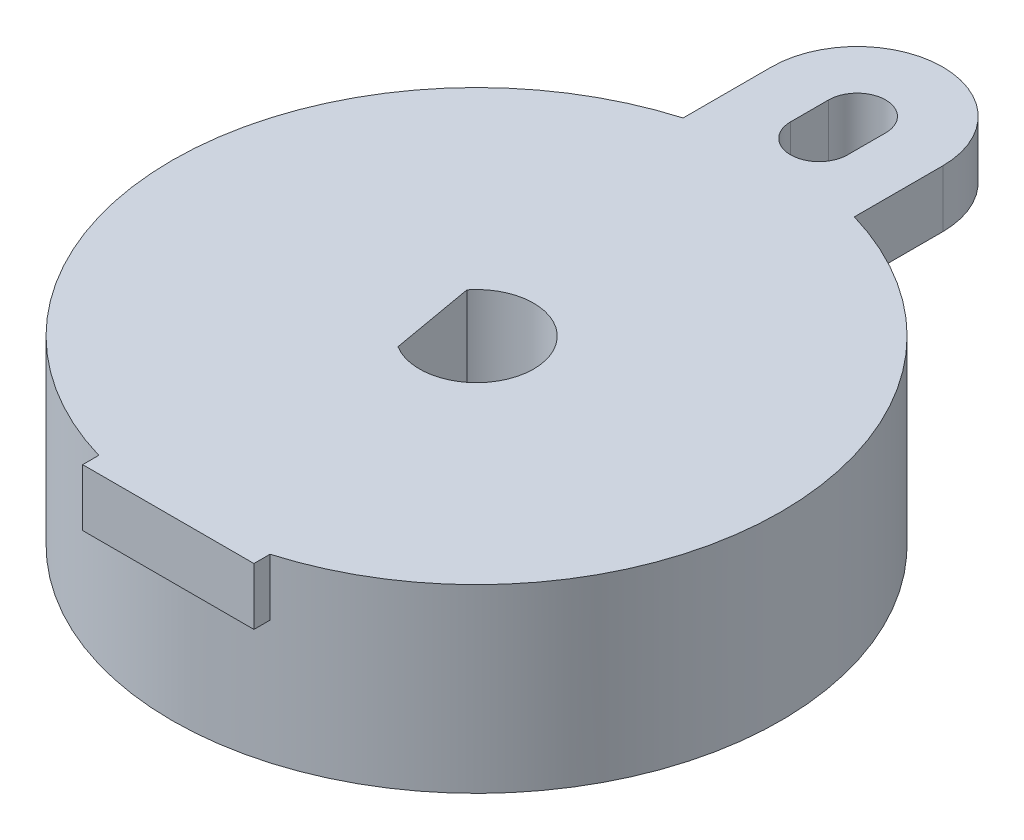
ISO-10303-21;
HEADER;
FILE_DESCRIPTION(('STEP AP214'),'2;1');
FILE_NAME('part.step','',(''),(''),'','','');
FILE_SCHEMA(('AUTOMOTIVE_DESIGN { 1 0 10303 214 1 1 1 1 }'));
ENDSEC;
DATA;
#1=APPLICATION_CONTEXT('core data for automotive mechanical design processes');
#2=APPLICATION_PROTOCOL_DEFINITION('international standard','automotive_design',2000,#1);
#3=PRODUCT_CONTEXT('',#1,'mechanical');
#4=PRODUCT('Part','Part','',(#3));
#5=PRODUCT_RELATED_PRODUCT_CATEGORY('part','',(#4));
#6=PRODUCT_DEFINITION_FORMATION('','',#4);
#7=PRODUCT_DEFINITION_CONTEXT('part definition',#1,'design');
#8=PRODUCT_DEFINITION('design','',#6,#7);
#9=PRODUCT_DEFINITION_SHAPE('','',#8);
#10=(LENGTH_UNIT() NAMED_UNIT(*) SI_UNIT(.MILLI.,.METRE.));
#11=(NAMED_UNIT(*) PLANE_ANGLE_UNIT() SI_UNIT($,.RADIAN.));
#12=(NAMED_UNIT(*) SI_UNIT($,.STERADIAN.) SOLID_ANGLE_UNIT());
#13=UNCERTAINTY_MEASURE_WITH_UNIT(LENGTH_MEASURE(1.E-05),#10,'distance_accuracy_value','');
#14=(GEOMETRIC_REPRESENTATION_CONTEXT(3) GLOBAL_UNCERTAINTY_ASSIGNED_CONTEXT((#13)) GLOBAL_UNIT_ASSIGNED_CONTEXT((#10,
#11,#12)) REPRESENTATION_CONTEXT('',''));
#15=CARTESIAN_POINT('',(0.,0.,0.));
#16=DIRECTION('',(0.,0.,1.));
#17=DIRECTION('',(1.,0.,0.));
#18=AXIS2_PLACEMENT_3D('',#15,#16,#17);
#19=CARTESIAN_POINT('',(-4.5,9.5,20.));
#20=DIRECTION('',(-1.,0.,0.));
#21=DIRECTION('',(0.,0.,1.));
#22=AXIS2_PLACEMENT_3D('',#19,#20,#21);
#23=PLANE('',#22);
#24=DIRECTION('',(0.,1.,0.));
#25=VECTOR('',#24,1.);
#26=CARTESIAN_POINT('',(-4.50000000000001,9.5,15.3541525327841));
#27=LINE('',#26,#25);
#28=CARTESIAN_POINT('',(-4.50000000000001,6.5,15.3541525327841));
#29=VERTEX_POINT('',#28);
#30=CARTESIAN_POINT('',(-4.50000000000001,9.5,15.3541525327841));
#31=VERTEX_POINT('',#30);
#32=EDGE_CURVE('E141',#29,#31,#27,.T.);
#33=ORIENTED_EDGE('',*,*,#32,.F.);
#34=DIRECTION('',(0.,0.,1.));
#35=VECTOR('',#34,1.);
#36=CARTESIAN_POINT('',(-4.5,6.5,0.));
#37=LINE('',#36,#35);
#38=CARTESIAN_POINT('',(-4.5,6.5,16.2));
#39=VERTEX_POINT('',#38);
#40=EDGE_CURVE('E157',#29,#39,#37,.T.);
#41=ORIENTED_EDGE('',*,*,#40,.T.);
#42=DIRECTION('',(0.,1.,0.));
#43=VECTOR('',#42,1.);
#44=CARTESIAN_POINT('',(-4.50000000000001,-75.7369297077063,16.2));
#45=LINE('',#44,#43);
#46=CARTESIAN_POINT('',(-4.50000000000001,9.5,16.2));
#47=VERTEX_POINT('',#46);
#48=EDGE_CURVE('E198',#39,#47,#45,.T.);
#49=ORIENTED_EDGE('',*,*,#48,.T.);
#50=DIRECTION('',(0.,0.,1.));
#51=VECTOR('',#50,1.);
#52=CARTESIAN_POINT('',(-4.5,9.5,20.));
#53=LINE('',#52,#51);
#54=EDGE_CURVE('E169',#47,#31,#53,.F.);
#55=ORIENTED_EDGE('',*,*,#54,.T.);
#56=EDGE_LOOP('',(#33,#41,#49,#55));
#57=FACE_BOUND('',#56,.T.);
#58=ADVANCED_FACE('F18',(#57),#23,.T.);
#59=CARTESIAN_POINT('',(4.5,9.5,20.));
#60=DIRECTION('',(1.,0.,0.));
#61=DIRECTION('',(0.,0.,-1.));
#62=AXIS2_PLACEMENT_3D('',#59,#60,#61);
#63=PLANE('',#62);
#64=DIRECTION('',(0.,1.,0.));
#65=VECTOR('',#64,1.);
#66=CARTESIAN_POINT('',(4.5,9.5,15.3541525327841));
#67=LINE('',#66,#65);
#68=CARTESIAN_POINT('',(4.5,9.5,15.3541525327841));
#69=VERTEX_POINT('',#68);
#70=CARTESIAN_POINT('',(4.50000000000001,6.5,15.3541525327841));
#71=VERTEX_POINT('',#70);
#72=EDGE_CURVE('E241',#69,#71,#67,.F.);
#73=ORIENTED_EDGE('',*,*,#72,.F.);
#74=DIRECTION('',(0.,0.,-1.));
#75=VECTOR('',#74,1.);
#76=CARTESIAN_POINT('',(4.5,9.5,20.));
#77=LINE('',#76,#75);
#78=CARTESIAN_POINT('',(4.5,9.5,16.2));
#79=VERTEX_POINT('',#78);
#80=EDGE_CURVE('E163',#69,#79,#77,.F.);
#81=ORIENTED_EDGE('',*,*,#80,.T.);
#82=DIRECTION('',(0.,1.,0.));
#83=VECTOR('',#82,1.);
#84=CARTESIAN_POINT('',(4.5,-75.7369297077063,16.2));
#85=LINE('',#84,#83);
#86=CARTESIAN_POINT('',(4.50000000000001,6.5,16.2));
#87=VERTEX_POINT('',#86);
#88=EDGE_CURVE('E192',#79,#87,#85,.F.);
#89=ORIENTED_EDGE('',*,*,#88,.T.);
#90=DIRECTION('',(0.,0.,1.));
#91=VECTOR('',#90,1.);
#92=CARTESIAN_POINT('',(4.50000000000001,6.5,0.));
#93=LINE('',#92,#91);
#94=EDGE_CURVE('E153',#87,#71,#93,.F.);
#95=ORIENTED_EDGE('',*,*,#94,.T.);
#96=EDGE_LOOP('',(#73,#81,#89,#95));
#97=FACE_BOUND('',#96,.T.);
#98=ADVANCED_FACE('F357',(#97),#63,.T.);
#99=CARTESIAN_POINT('',(0.,6.5,0.));
#100=DIRECTION('',(0.,1.,0.));
#101=DIRECTION('',(0.,0.,1.));
#102=AXIS2_PLACEMENT_3D('',#99,#100,#101);
#103=PLANE('',#102);
#104=DIRECTION('',(-1.,0.,0.));
#105=VECTOR('',#104,1.);
#106=CARTESIAN_POINT('',(12.8325225410958,6.50000000000001,16.2));
#107=LINE('',#106,#105);
#108=EDGE_CURVE('E188',#87,#39,#107,.T.);
#109=ORIENTED_EDGE('',*,*,#108,.T.);
#110=ORIENTED_EDGE('',*,*,#40,.F.);
#111=CARTESIAN_POINT('',(0.,6.5,0.));
#112=DIRECTION('',(0.,1.,0.));
#113=DIRECTION('',(0.,0.,1.));
#114=AXIS2_PLACEMENT_3D('',#111,#112,#113);
#115=CIRCLE('',#114,16.);
#116=EDGE_CURVE('E204',#71,#29,#115,.F.);
#117=ORIENTED_EDGE('',*,*,#116,.F.);
#118=ORIENTED_EDGE('',*,*,#94,.F.);
#119=EDGE_LOOP('',(#109,#110,#117,#118));
#120=FACE_BOUND('',#119,.T.);
#121=ADVANCED_FACE('F262',(#120),#103,.F.);
#122=CARTESIAN_POINT('',(0.,6.5,0.));
#123=DIRECTION('',(0.,-1.,0.));
#124=DIRECTION('',(0.,0.,-1.));
#125=AXIS2_PLACEMENT_3D('',#122,#123,#124);
#126=PLANE('',#125);
#127=CARTESIAN_POINT('',(0.,6.5,-18.));
#128=DIRECTION('',(0.,1.,0.));
#129=DIRECTION('',(0.,0.,1.));
#130=AXIS2_PLACEMENT_3D('',#127,#128,#129);
#131=CIRCLE('',#130,1.5);
#132=CARTESIAN_POINT('',(-1.5,6.5,-18.));
#133=VERTEX_POINT('',#132);
#134=CARTESIAN_POINT('',(1.5,6.5,-18.));
#135=VERTEX_POINT('',#134);
#136=EDGE_CURVE('E119',#133,#135,#131,.T.);
#137=ORIENTED_EDGE('',*,*,#136,.T.);
#138=DIRECTION('',(0.,0.,-1.));
#139=VECTOR('',#138,1.);
#140=CARTESIAN_POINT('',(1.5,6.5,-18.));
#141=LINE('',#140,#139);
#142=CARTESIAN_POINT('',(1.5,6.5,-20.));
#143=VERTEX_POINT('',#142);
#144=EDGE_CURVE('E148',#135,#143,#141,.T.);
#145=ORIENTED_EDGE('',*,*,#144,.T.);
#146=CARTESIAN_POINT('',(0.,6.5,-20.));
#147=DIRECTION('',(0.,1.,0.));
#148=DIRECTION('',(0.,0.,1.));
#149=AXIS2_PLACEMENT_3D('',#146,#147,#148);
#150=CIRCLE('',#149,1.5);
#151=CARTESIAN_POINT('',(-1.5,6.5,-20.));
#152=VERTEX_POINT('',#151);
#153=EDGE_CURVE('E236',#143,#152,#150,.T.);
#154=ORIENTED_EDGE('',*,*,#153,.T.);
#155=DIRECTION('',(0.,0.,1.));
#156=VECTOR('',#155,1.);
#157=CARTESIAN_POINT('',(-1.5,6.5,-18.));
#158=LINE('',#157,#156);
#159=EDGE_CURVE('E143',#152,#133,#158,.T.);
#160=ORIENTED_EDGE('',*,*,#159,.T.);
#161=EDGE_LOOP('',(#137,#145,#154,#160));
#162=FACE_BOUND('',#161,.T.);
#163=DIRECTION('',(0.,0.,1.));
#164=VECTOR('',#163,1.);
#165=CARTESIAN_POINT('',(-4.5,6.5,-20.));
#166=LINE('',#165,#164);
#167=CARTESIAN_POINT('',(-4.5,6.5,-20.));
#168=VERTEX_POINT('',#167);
#169=CARTESIAN_POINT('',(-4.50000000000001,6.5,-15.3541525327841));
#170=VERTEX_POINT('',#169);
#171=EDGE_CURVE('E178',#168,#170,#166,.T.);
#172=ORIENTED_EDGE('',*,*,#171,.F.);
#173=CARTESIAN_POINT('',(0.,6.5,-20.));
#174=DIRECTION('',(0.,1.,0.));
#175=DIRECTION('',(0.,0.,1.));
#176=AXIS2_PLACEMENT_3D('',#173,#174,#175);
#177=CIRCLE('',#176,4.5);
#178=CARTESIAN_POINT('',(4.5,6.5,-20.));
#179=VERTEX_POINT('',#178);
#180=EDGE_CURVE('E21',#179,#168,#177,.T.);
#181=ORIENTED_EDGE('',*,*,#180,.F.);
#182=DIRECTION('',(0.,0.,-1.));
#183=VECTOR('',#182,1.);
#184=CARTESIAN_POINT('',(4.5,6.5,-20.));
#185=LINE('',#184,#183);
#186=CARTESIAN_POINT('',(4.49999999999999,6.5,-15.3541525327841));
#187=VERTEX_POINT('',#186);
#188=EDGE_CURVE('E172',#187,#179,#185,.T.);
#189=ORIENTED_EDGE('',*,*,#188,.F.);
#190=CARTESIAN_POINT('',(0.,6.5,0.));
#191=DIRECTION('',(0.,1.,0.));
#192=DIRECTION('',(0.,0.,1.));
#193=AXIS2_PLACEMENT_3D('',#190,#191,#192);
#194=CIRCLE('',#193,16.);
#195=EDGE_CURVE('E242',#170,#187,#194,.F.);
#196=ORIENTED_EDGE('',*,*,#195,.F.);
#197=EDGE_LOOP('',(#172,#181,#189,#196));
#198=FACE_BOUND('',#197,.T.);
#199=ADVANCED_FACE('F252',(#162,#198),#126,.T.);
#200=CARTESIAN_POINT('',(0.,0.,20.));
#201=DIRECTION('',(0.,-1.,0.));
#202=DIRECTION('',(0.,0.,-1.));
#203=AXIS2_PLACEMENT_3D('',#200,#201,#202);
#204=PLANE('',#203);
#205=CARTESIAN_POINT('',(0.,0.,0.));
#206=DIRECTION('',(0.,1.,0.));
#207=DIRECTION('',(0.,0.,1.));
#208=AXIS2_PLACEMENT_3D('',#205,#206,#207);
#209=CIRCLE('',#208,3.);
#210=CARTESIAN_POINT('',(-1.5813263765922,0.,2.54939343583798));
#211=VERTEX_POINT('',#210);
#212=CARTESIAN_POINT('',(-2.35790463545664,0.,-1.85480072517026));
#213=VERTEX_POINT('',#212);
#214=EDGE_CURVE('E110',#211,#213,#209,.T.);
#215=ORIENTED_EDGE('',*,*,#214,.T.);
#216=DIRECTION('',(0.173648177666931,0.,0.984807753012208));
#217=VECTOR('',#216,1.);
#218=CARTESIAN_POINT('',(-1.5813263765922,0.,2.54939343583798));
#219=LINE('',#218,#217);
#220=EDGE_CURVE('E123',#213,#211,#219,.T.);
#221=ORIENTED_EDGE('',*,*,#220,.T.);
#222=EDGE_LOOP('',(#215,#221));
#223=FACE_BOUND('',#222,.T.);
#224=CARTESIAN_POINT('',(0.,0.,0.));
#225=DIRECTION('',(0.,1.,0.));
#226=DIRECTION('',(0.,0.,1.));
#227=AXIS2_PLACEMENT_3D('',#224,#225,#226);
#228=CIRCLE('',#227,16.);
#229=CARTESIAN_POINT('',(0.,0.,16.));
#230=VERTEX_POINT('',#229);
#231=EDGE_CURVE('E176',#230,#230,#228,.T.);
#232=ORIENTED_EDGE('',*,*,#231,.F.);
#233=EDGE_LOOP('',(#232));
#234=FACE_BOUND('',#233,.T.);
#235=ADVANCED_FACE('F126',(#223,#234),#204,.T.);
#236=CARTESIAN_POINT('',(-4.5,9.5,-20.));
#237=DIRECTION('',(-1.,0.,0.));
#238=DIRECTION('',(0.,0.,1.));
#239=AXIS2_PLACEMENT_3D('',#236,#237,#238);
#240=PLANE('',#239);
#241=DIRECTION('',(0.,1.,0.));
#242=VECTOR('',#241,1.);
#243=CARTESIAN_POINT('',(-4.49999999999999,9.5,-20.));
#244=LINE('',#243,#242);
#245=CARTESIAN_POINT('',(-4.49999999999999,9.5,-20.));
#246=VERTEX_POINT('',#245);
#247=EDGE_CURVE('E182',#168,#246,#244,.T.);
#248=ORIENTED_EDGE('',*,*,#247,.F.);
#249=ORIENTED_EDGE('',*,*,#171,.T.);
#250=DIRECTION('',(0.,1.,0.));
#251=VECTOR('',#250,1.);
#252=CARTESIAN_POINT('',(-4.50000000000001,9.5,-15.3541525327841));
#253=LINE('',#252,#251);
#254=CARTESIAN_POINT('',(-4.5,9.5,-15.3541525327841));
#255=VERTEX_POINT('',#254);
#256=EDGE_CURVE('E183',#170,#255,#253,.T.);
#257=ORIENTED_EDGE('',*,*,#256,.T.);
#258=DIRECTION('',(0.,0.,-1.));
#259=VECTOR('',#258,1.);
#260=CARTESIAN_POINT('',(-4.5,9.5,20.));
#261=LINE('',#260,#259);
#262=EDGE_CURVE('E135',#255,#246,#261,.T.);
#263=ORIENTED_EDGE('',*,*,#262,.T.);
#264=EDGE_LOOP('',(#248,#249,#257,#263));
#265=FACE_BOUND('',#264,.T.);
#266=ADVANCED_FACE('F251',(#265),#240,.T.);
#267=CARTESIAN_POINT('',(0.,9.5,-20.));
#268=DIRECTION('',(0.,1.,0.));
#269=DIRECTION('',(0.,0.,1.));
#270=AXIS2_PLACEMENT_3D('',#267,#268,#269);
#271=CYLINDRICAL_SURFACE('',#270,4.5);
#272=DIRECTION('',(0.,1.,0.));
#273=VECTOR('',#272,1.);
#274=CARTESIAN_POINT('',(4.5,9.5,-20.));
#275=LINE('',#274,#273);
#276=CARTESIAN_POINT('',(4.5,9.5,-20.));
#277=VERTEX_POINT('',#276);
#278=EDGE_CURVE('E177',#179,#277,#275,.T.);
#279=ORIENTED_EDGE('',*,*,#278,.F.);
#280=ORIENTED_EDGE('',*,*,#180,.T.);
#281=ORIENTED_EDGE('',*,*,#247,.T.);
#282=CARTESIAN_POINT('',(0.,9.5,-20.));
#283=DIRECTION('',(0.,1.,0.));
#284=DIRECTION('',(0.,0.,1.));
#285=AXIS2_PLACEMENT_3D('',#282,#283,#284);
#286=CIRCLE('',#285,4.5);
#287=EDGE_CURVE('E230',#246,#277,#286,.F.);
#288=ORIENTED_EDGE('',*,*,#287,.T.);
#289=EDGE_LOOP('',(#279,#280,#281,#288));
#290=FACE_BOUND('',#289,.T.);
#291=ADVANCED_FACE('F259',(#290),#271,.T.);
#292=CARTESIAN_POINT('',(4.5,9.5,-20.));
#293=DIRECTION('',(1.,0.,0.));
#294=DIRECTION('',(0.,0.,-1.));
#295=AXIS2_PLACEMENT_3D('',#292,#293,#294);
#296=PLANE('',#295);
#297=DIRECTION('',(0.,1.,0.));
#298=VECTOR('',#297,1.);
#299=CARTESIAN_POINT('',(4.49999999999999,9.5,-15.3541525327841));
#300=LINE('',#299,#298);
#301=CARTESIAN_POINT('',(4.5,9.5,-15.3541525327841));
#302=VERTEX_POINT('',#301);
#303=EDGE_CURVE('E244',#187,#302,#300,.T.);
#304=ORIENTED_EDGE('',*,*,#303,.F.);
#305=ORIENTED_EDGE('',*,*,#188,.T.);
#306=ORIENTED_EDGE('',*,*,#278,.T.);
#307=DIRECTION('',(0.,0.,-1.));
#308=VECTOR('',#307,1.);
#309=CARTESIAN_POINT('',(4.5,9.5,20.));
#310=LINE('',#309,#308);
#311=EDGE_CURVE('E229',#277,#302,#310,.F.);
#312=ORIENTED_EDGE('',*,*,#311,.T.);
#313=EDGE_LOOP('',(#304,#305,#306,#312));
#314=FACE_BOUND('',#313,.T.);
#315=ADVANCED_FACE('F298',(#314),#296,.T.);
#316=CARTESIAN_POINT('',(0.,9.5,0.));
#317=DIRECTION('',(0.,1.,0.));
#318=DIRECTION('',(0.,0.,1.));
#319=AXIS2_PLACEMENT_3D('',#316,#317,#318);
#320=CYLINDRICAL_SURFACE('',#319,16.);
#321=ORIENTED_EDGE('',*,*,#256,.F.);
#322=ORIENTED_EDGE('',*,*,#195,.T.);
#323=ORIENTED_EDGE('',*,*,#303,.T.);
#324=CARTESIAN_POINT('',(0.,9.5,0.));
#325=DIRECTION('',(0.,1.,0.));
#326=DIRECTION('',(0.,0.,1.));
#327=AXIS2_PLACEMENT_3D('',#324,#325,#326);
#328=CIRCLE('',#327,16.);
#329=EDGE_CURVE('E212',#302,#69,#328,.F.);
#330=ORIENTED_EDGE('',*,*,#329,.T.);
#331=ORIENTED_EDGE('',*,*,#72,.T.);
#332=ORIENTED_EDGE('',*,*,#116,.T.);
#333=ORIENTED_EDGE('',*,*,#32,.T.);
#334=CARTESIAN_POINT('',(0.,9.5,0.));
#335=DIRECTION('',(0.,1.,0.));
#336=DIRECTION('',(0.,0.,1.));
#337=AXIS2_PLACEMENT_3D('',#334,#335,#336);
#338=CIRCLE('',#337,16.);
#339=EDGE_CURVE('E129',#31,#255,#338,.F.);
#340=ORIENTED_EDGE('',*,*,#339,.T.);
#341=EDGE_LOOP('',(#321,#322,#323,#330,#331,#332,#333,#340));
#342=FACE_BOUND('',#341,.T.);
#343=ORIENTED_EDGE('',*,*,#231,.T.);
#344=EDGE_LOOP('',(#343));
#345=FACE_BOUND('',#344,.T.);
#346=ADVANCED_FACE('F249',(#342,#345),#320,.T.);
#347=CARTESIAN_POINT('',(12.8325225410958,-75.7369297077063,16.2));
#348=DIRECTION('',(0.,0.,-1.));
#349=DIRECTION('',(-1.,0.,0.));
#350=AXIS2_PLACEMENT_3D('',#347,#348,#349);
#351=PLANE('',#350);
#352=ORIENTED_EDGE('',*,*,#88,.F.);
#353=DIRECTION('',(1.,0.,0.));
#354=VECTOR('',#353,1.);
#355=CARTESIAN_POINT('',(0.,9.5,16.2));
#356=LINE('',#355,#354);
#357=EDGE_CURVE('E207',#79,#47,#356,.F.);
#358=ORIENTED_EDGE('',*,*,#357,.T.);
#359=ORIENTED_EDGE('',*,*,#48,.F.);
#360=ORIENTED_EDGE('',*,*,#108,.F.);
#361=EDGE_LOOP('',(#352,#358,#359,#360));
#362=FACE_BOUND('',#361,.T.);
#363=ADVANCED_FACE('F291',(#362),#351,.F.);
#364=CARTESIAN_POINT('',(1.5,59.289543766165,-18.));
#365=DIRECTION('',(1.,0.,0.));
#366=DIRECTION('',(0.,0.,-1.));
#367=AXIS2_PLACEMENT_3D('',#364,#365,#366);
#368=PLANE('',#367);
#369=DIRECTION('',(0.,1.,0.));
#370=VECTOR('',#369,1.);
#371=CARTESIAN_POINT('',(1.5,59.289543766165,-18.));
#372=LINE('',#371,#370);
#373=CARTESIAN_POINT('',(1.5,9.5,-18.));
#374=VERTEX_POINT('',#373);
#375=EDGE_CURVE('E152',#374,#135,#372,.F.);
#376=ORIENTED_EDGE('',*,*,#375,.F.);
#377=DIRECTION('',(0.,0.,-1.));
#378=VECTOR('',#377,1.);
#379=CARTESIAN_POINT('',(1.5,9.5,20.));
#380=LINE('',#379,#378);
#381=CARTESIAN_POINT('',(1.5,9.5,-20.));
#382=VERTEX_POINT('',#381);
#383=EDGE_CURVE('E222',#374,#382,#380,.T.);
#384=ORIENTED_EDGE('',*,*,#383,.T.);
#385=DIRECTION('',(0.,1.,0.));
#386=VECTOR('',#385,1.);
#387=CARTESIAN_POINT('',(1.5,59.289543766165,-20.));
#388=LINE('',#387,#386);
#389=EDGE_CURVE('E151',#382,#143,#388,.F.);
#390=ORIENTED_EDGE('',*,*,#389,.T.);
#391=ORIENTED_EDGE('',*,*,#144,.F.);
#392=EDGE_LOOP('',(#376,#384,#390,#391));
#393=FACE_BOUND('',#392,.T.);
#394=ADVANCED_FACE('F287',(#393),#368,.F.);
#395=CARTESIAN_POINT('',(0.,59.289543766165,-20.));
#396=DIRECTION('',(0.,1.,0.));
#397=DIRECTION('',(0.,0.,1.));
#398=AXIS2_PLACEMENT_3D('',#395,#396,#397);
#399=CYLINDRICAL_SURFACE('',#398,1.5);
#400=ORIENTED_EDGE('',*,*,#389,.F.);
#401=CARTESIAN_POINT('',(0.,9.5,-20.));
#402=DIRECTION('',(0.,1.,0.));
#403=DIRECTION('',(0.,0.,1.));
#404=AXIS2_PLACEMENT_3D('',#401,#402,#403);
#405=CIRCLE('',#404,1.5);
#406=CARTESIAN_POINT('',(-1.5,9.5,-20.));
#407=VERTEX_POINT('',#406);
#408=EDGE_CURVE('E218',#382,#407,#405,.T.);
#409=ORIENTED_EDGE('',*,*,#408,.T.);
#410=DIRECTION('',(0.,1.,0.));
#411=VECTOR('',#410,1.);
#412=CARTESIAN_POINT('',(-1.5,59.289543766165,-20.));
#413=LINE('',#412,#411);
#414=EDGE_CURVE('E147',#407,#152,#413,.F.);
#415=ORIENTED_EDGE('',*,*,#414,.T.);
#416=ORIENTED_EDGE('',*,*,#153,.F.);
#417=EDGE_LOOP('',(#400,#409,#415,#416));
#418=FACE_BOUND('',#417,.T.);
#419=ADVANCED_FACE('F283',(#418),#399,.F.);
#420=CARTESIAN_POINT('',(-1.5,59.289543766165,-18.));
#421=DIRECTION('',(-1.,0.,0.));
#422=DIRECTION('',(0.,0.,1.));
#423=AXIS2_PLACEMENT_3D('',#420,#421,#422);
#424=PLANE('',#423);
#425=ORIENTED_EDGE('',*,*,#414,.F.);
#426=DIRECTION('',(0.,0.,-1.));
#427=VECTOR('',#426,1.);
#428=CARTESIAN_POINT('',(-1.5,9.5,20.));
#429=LINE('',#428,#427);
#430=CARTESIAN_POINT('',(-1.5,9.5,-18.));
#431=VERTEX_POINT('',#430);
#432=EDGE_CURVE('E217',#407,#431,#429,.F.);
#433=ORIENTED_EDGE('',*,*,#432,.T.);
#434=DIRECTION('',(0.,1.,0.));
#435=VECTOR('',#434,1.);
#436=CARTESIAN_POINT('',(-1.5,59.289543766165,-18.));
#437=LINE('',#436,#435);
#438=EDGE_CURVE('E146',#431,#133,#437,.F.);
#439=ORIENTED_EDGE('',*,*,#438,.T.);
#440=ORIENTED_EDGE('',*,*,#159,.F.);
#441=EDGE_LOOP('',(#425,#433,#439,#440));
#442=FACE_BOUND('',#441,.T.);
#443=ADVANCED_FACE('F279',(#442),#424,.F.);
#444=CARTESIAN_POINT('',(0.,59.289543766165,-18.));
#445=DIRECTION('',(0.,1.,0.));
#446=DIRECTION('',(0.,0.,1.));
#447=AXIS2_PLACEMENT_3D('',#444,#445,#446);
#448=CYLINDRICAL_SURFACE('',#447,1.5);
#449=ORIENTED_EDGE('',*,*,#136,.F.);
#450=ORIENTED_EDGE('',*,*,#438,.F.);
#451=CARTESIAN_POINT('',(0.,9.5,-18.));
#452=DIRECTION('',(0.,1.,0.));
#453=DIRECTION('',(0.,0.,1.));
#454=AXIS2_PLACEMENT_3D('',#451,#452,#453);
#455=CIRCLE('',#454,1.5);
#456=EDGE_CURVE('E211',#431,#374,#455,.T.);
#457=ORIENTED_EDGE('',*,*,#456,.T.);
#458=ORIENTED_EDGE('',*,*,#375,.T.);
#459=EDGE_LOOP('',(#449,#450,#457,#458));
#460=FACE_BOUND('',#459,.T.);
#461=ADVANCED_FACE('F276',(#460),#448,.F.);
#462=CARTESIAN_POINT('',(0.,59.289543766165,0.));
#463=DIRECTION('',(0.,1.,0.));
#464=DIRECTION('',(0.,0.,1.));
#465=AXIS2_PLACEMENT_3D('',#462,#463,#464);
#466=CYLINDRICAL_SURFACE('',#465,3.);
#467=ORIENTED_EDGE('',*,*,#214,.F.);
#468=DIRECTION('',(0.,1.,0.));
#469=VECTOR('',#468,1.);
#470=CARTESIAN_POINT('',(-1.5813263765922,59.289543766165,2.54939343583798));
#471=LINE('',#470,#469);
#472=CARTESIAN_POINT('',(-1.5813263765922,9.5,2.54939343583798));
#473=VERTEX_POINT('',#472);
#474=EDGE_CURVE('E113',#211,#473,#471,.T.);
#475=ORIENTED_EDGE('',*,*,#474,.T.);
#476=CARTESIAN_POINT('',(0.,9.5,0.));
#477=DIRECTION('',(0.,1.,0.));
#478=DIRECTION('',(0.,0.,1.));
#479=AXIS2_PLACEMENT_3D('',#476,#477,#478);
#480=CIRCLE('',#479,3.);
#481=CARTESIAN_POINT('',(-2.35790463545664,9.5,-1.85480072517026));
#482=VERTEX_POINT('',#481);
#483=EDGE_CURVE('E27',#473,#482,#480,.T.);
#484=ORIENTED_EDGE('',*,*,#483,.T.);
#485=DIRECTION('',(0.,1.,0.));
#486=VECTOR('',#485,1.);
#487=CARTESIAN_POINT('',(-2.35790463545664,59.289543766165,-1.85480072517026));
#488=LINE('',#487,#486);
#489=EDGE_CURVE('E114',#482,#213,#488,.F.);
#490=ORIENTED_EDGE('',*,*,#489,.T.);
#491=EDGE_LOOP('',(#467,#475,#484,#490));
#492=FACE_BOUND('',#491,.T.);
#493=ADVANCED_FACE('F112',(#492),#466,.F.);
#494=CARTESIAN_POINT('',(-1.5813263765922,59.289543766165,2.54939343583798));
#495=DIRECTION('',(-0.984807753012208,0.,0.173648177666931));
#496=DIRECTION('',(0.173648177666931,0.,0.984807753012208));
#497=AXIS2_PLACEMENT_3D('',#494,#495,#496);
#498=PLANE('',#497);
#499=ORIENTED_EDGE('',*,*,#489,.F.);
#500=DIRECTION('',(0.173648177666931,0.,0.984807753012208));
#501=VECTOR('',#500,1.);
#502=CARTESIAN_POINT('',(-2.35790463545664,9.5,-1.85480072517026));
#503=LINE('',#502,#501);
#504=EDGE_CURVE('E11',#482,#473,#503,.T.);
#505=ORIENTED_EDGE('',*,*,#504,.T.);
#506=ORIENTED_EDGE('',*,*,#474,.F.);
#507=ORIENTED_EDGE('',*,*,#220,.F.);
#508=EDGE_LOOP('',(#499,#505,#506,#507));
#509=FACE_BOUND('',#508,.T.);
#510=ADVANCED_FACE('F122',(#509),#498,.F.);
#511=CARTESIAN_POINT('',(0.,9.5,20.));
#512=DIRECTION('',(0.,-1.,0.));
#513=DIRECTION('',(0.,0.,-1.));
#514=AXIS2_PLACEMENT_3D('',#511,#512,#513);
#515=PLANE('',#514);
#516=ORIENTED_EDGE('',*,*,#504,.F.);
#517=ORIENTED_EDGE('',*,*,#483,.F.);
#518=EDGE_LOOP('',(#516,#517));
#519=FACE_BOUND('',#518,.T.);
#520=ORIENTED_EDGE('',*,*,#432,.F.);
#521=ORIENTED_EDGE('',*,*,#408,.F.);
#522=ORIENTED_EDGE('',*,*,#383,.F.);
#523=ORIENTED_EDGE('',*,*,#456,.F.);
#524=EDGE_LOOP('',(#520,#521,#522,#523));
#525=FACE_BOUND('',#524,.T.);
#526=ORIENTED_EDGE('',*,*,#357,.F.);
#527=ORIENTED_EDGE('',*,*,#80,.F.);
#528=ORIENTED_EDGE('',*,*,#329,.F.);
#529=ORIENTED_EDGE('',*,*,#311,.F.);
#530=ORIENTED_EDGE('',*,*,#287,.F.);
#531=ORIENTED_EDGE('',*,*,#262,.F.);
#532=ORIENTED_EDGE('',*,*,#339,.F.);
#533=ORIENTED_EDGE('',*,*,#54,.F.);
#534=EDGE_LOOP('',(#526,#527,#528,#529,#530,#531,#532,#533));
#535=FACE_BOUND('',#534,.T.);
#536=ADVANCED_FACE('F265',(#519,#525,#535),#515,.F.);
#537=CLOSED_SHELL('',(#58,#98,#121,#199,#235,#266,#291,#315,#346,#363,#394,#419,#443,#461,#493,
#510,#536));
#538=MANIFOLD_SOLID_BREP('B1',#537);
#539=ADVANCED_BREP_SHAPE_REPRESENTATION('',(#18,#538),#14);
#540=SHAPE_DEFINITION_REPRESENTATION(#9,#539);
ENDSEC;
END-ISO-10303-21;
